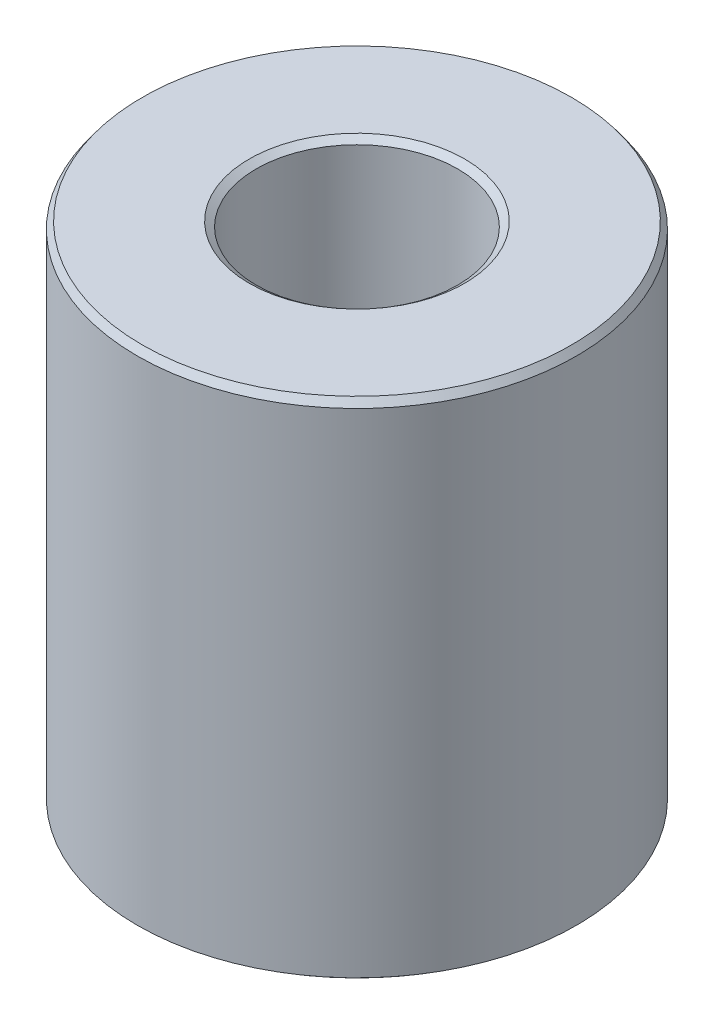
ISO-10303-21;
HEADER;
FILE_DESCRIPTION(('STEP AP214'),'2;1');
FILE_NAME('part.step','',(''),(''),'','','');
FILE_SCHEMA(('AUTOMOTIVE_DESIGN { 1 0 10303 214 1 1 1 1 }'));
ENDSEC;
DATA;
#1=APPLICATION_CONTEXT('core data for automotive mechanical design processes');
#2=APPLICATION_PROTOCOL_DEFINITION('international standard','automotive_design',2000,#1);
#3=PRODUCT_CONTEXT('',#1,'mechanical');
#4=PRODUCT('Part','Part','',(#3));
#5=PRODUCT_RELATED_PRODUCT_CATEGORY('part','',(#4));
#6=PRODUCT_DEFINITION_FORMATION('','',#4);
#7=PRODUCT_DEFINITION_CONTEXT('part definition',#1,'design');
#8=PRODUCT_DEFINITION('design','',#6,#7);
#9=PRODUCT_DEFINITION_SHAPE('','',#8);
#10=(LENGTH_UNIT() NAMED_UNIT(*) SI_UNIT(.MILLI.,.METRE.));
#11=(NAMED_UNIT(*) PLANE_ANGLE_UNIT() SI_UNIT($,.RADIAN.));
#12=(NAMED_UNIT(*) SI_UNIT($,.STERADIAN.) SOLID_ANGLE_UNIT());
#13=UNCERTAINTY_MEASURE_WITH_UNIT(LENGTH_MEASURE(1.E-05),#10,'distance_accuracy_value','');
#14=(GEOMETRIC_REPRESENTATION_CONTEXT(3) GLOBAL_UNCERTAINTY_ASSIGNED_CONTEXT((#13)) GLOBAL_UNIT_ASSIGNED_CONTEXT((#10,
#11,#12)) REPRESENTATION_CONTEXT('',''));
#15=CARTESIAN_POINT('',(0.,0.,0.));
#16=DIRECTION('',(0.,0.,1.));
#17=DIRECTION('',(1.,0.,0.));
#18=AXIS2_PLACEMENT_3D('',#15,#16,#17);
#19=CARTESIAN_POINT('',(0.,126.513965397112,0.));
#20=DIRECTION('',(0.,-1.,0.));
#21=DIRECTION('',(0.,0.,-1.));
#22=AXIS2_PLACEMENT_3D('',#19,#20,#21);
#23=CYLINDRICAL_SURFACE('',#22,55.);
#24=CARTESIAN_POINT('',(0.,1.26517147994276,0.));
#25=DIRECTION('',(0.,1.,0.));
#26=DIRECTION('',(0.,0.,1.));
#27=AXIS2_PLACEMENT_3D('',#24,#25,#26);
#28=CIRCLE('',#27,55.);
#29=CARTESIAN_POINT('',(0.,1.26517147994276,55.));
#30=VERTEX_POINT('',#29);
#31=EDGE_CURVE('E10',#30,#30,#28,.T.);
#32=ORIENTED_EDGE('',*,*,#31,.T.);
#33=EDGE_LOOP('',(#32));
#34=FACE_BOUND('',#33,.T.);
#35=CARTESIAN_POINT('',(0.,124.761026844225,0.));
#36=DIRECTION('',(0.,1.,0.));
#37=DIRECTION('',(0.,0.,1.));
#38=AXIS2_PLACEMENT_3D('',#35,#36,#37);
#39=CIRCLE('',#38,55.);
#40=CARTESIAN_POINT('',(0.,124.761026844225,55.));
#41=VERTEX_POINT('',#40);
#42=EDGE_CURVE('E50',#41,#41,#39,.F.);
#43=ORIENTED_EDGE('',*,*,#42,.T.);
#44=EDGE_LOOP('',(#43));
#45=FACE_BOUND('',#44,.T.);
#46=ADVANCED_FACE('F39',(#34,#45),#23,.T.);
#47=CARTESIAN_POINT('',(0.,126.513965397112,0.));
#48=DIRECTION('',(0.,1.,0.));
#49=DIRECTION('',(0.,0.,1.));
#50=AXIS2_PLACEMENT_3D('',#47,#48,#49);
#51=PLANE('',#50);
#52=CARTESIAN_POINT('',(0.,126.513965397112,0.));
#53=DIRECTION('',(0.,1.,0.));
#54=DIRECTION('',(0.,0.,1.));
#55=AXIS2_PLACEMENT_3D('',#52,#53,#54);
#56=CIRCLE('',#55,26.9830047385844);
#57=CARTESIAN_POINT('',(0.,126.513965397112,26.9830047385844));
#58=VERTEX_POINT('',#57);
#59=EDGE_CURVE('E58',#58,#58,#56,.F.);
#60=ORIENTED_EDGE('',*,*,#59,.T.);
#61=EDGE_LOOP('',(#60));
#62=FACE_BOUND('',#61,.T.);
#63=CARTESIAN_POINT('',(0.,126.513965397112,0.));
#64=DIRECTION('',(0.,1.,0.));
#65=DIRECTION('',(0.,0.,1.));
#66=AXIS2_PLACEMENT_3D('',#63,#64,#65);
#67=CIRCLE('',#66,53.7348285200572);
#68=CARTESIAN_POINT('',(0.,126.513965397112,53.7348285200572));
#69=VERTEX_POINT('',#68);
#70=EDGE_CURVE('E61',#69,#69,#67,.T.);
#71=ORIENTED_EDGE('',*,*,#70,.T.);
#72=EDGE_LOOP('',(#71));
#73=FACE_BOUND('',#72,.T.);
#74=ADVANCED_FACE('F88',(#62,#73),#51,.T.);
#75=CARTESIAN_POINT('',(0.,0.,0.));
#76=DIRECTION('',(0.,1.,0.));
#77=DIRECTION('',(0.,0.,1.));
#78=AXIS2_PLACEMENT_3D('',#75,#76,#77);
#79=PLANE('',#78);
#80=CARTESIAN_POINT('',(0.,0.,0.));
#81=DIRECTION('',(0.,1.,0.));
#82=DIRECTION('',(0.,0.,1.));
#83=AXIS2_PLACEMENT_3D('',#80,#81,#82);
#84=CIRCLE('',#83,26.4952376656398);
#85=CARTESIAN_POINT('',(0.,0.,-26.4952376656398));
#86=VERTEX_POINT('',#85);
#87=EDGE_CURVE('E51',#86,#86,#84,.T.);
#88=ORIENTED_EDGE('',*,*,#87,.T.);
#89=EDGE_LOOP('',(#88));
#90=FACE_BOUND('',#89,.T.);
#91=CARTESIAN_POINT('',(0.,0.,0.));
#92=DIRECTION('',(0.,1.,0.));
#93=DIRECTION('',(0.,0.,1.));
#94=AXIS2_PLACEMENT_3D('',#91,#92,#93);
#95=CIRCLE('',#94,53.2470614471127);
#96=CARTESIAN_POINT('',(0.,0.,53.2470614471127));
#97=VERTEX_POINT('',#96);
#98=EDGE_CURVE('E54',#97,#97,#95,.F.);
#99=ORIENTED_EDGE('',*,*,#98,.T.);
#100=EDGE_LOOP('',(#99));
#101=FACE_BOUND('',#100,.T.);
#102=ADVANCED_FACE('F83',(#90,#101),#79,.F.);
#103=CARTESIAN_POINT('',(0.,126.513965397112,0.));
#104=DIRECTION('',(0.,-1.,0.));
#105=DIRECTION('',(0.,0.,-1.));
#106=AXIS2_PLACEMENT_3D('',#103,#104,#105);
#107=CYLINDRICAL_SURFACE('',#106,25.230066185697);
#108=CARTESIAN_POINT('',(0.,125.248793917169,0.));
#109=DIRECTION('',(0.,1.,0.));
#110=DIRECTION('',(0.,0.,1.));
#111=AXIS2_PLACEMENT_3D('',#108,#109,#110);
#112=CIRCLE('',#111,25.230066185697);
#113=CARTESIAN_POINT('',(0.,125.248793917169,25.230066185697));
#114=VERTEX_POINT('',#113);
#115=EDGE_CURVE('E67',#114,#114,#112,.T.);
#116=ORIENTED_EDGE('',*,*,#115,.T.);
#117=EDGE_LOOP('',(#116));
#118=FACE_BOUND('',#117,.T.);
#119=CARTESIAN_POINT('',(0.,1.75293855288738,0.));
#120=DIRECTION('',(0.,1.,0.));
#121=DIRECTION('',(0.,0.,1.));
#122=AXIS2_PLACEMENT_3D('',#119,#120,#121);
#123=CIRCLE('',#122,25.230066185697);
#124=CARTESIAN_POINT('',(0.,1.75293855288738,-25.230066185697));
#125=VERTEX_POINT('',#124);
#126=EDGE_CURVE('E69',#125,#125,#123,.F.);
#127=ORIENTED_EDGE('',*,*,#126,.T.);
#128=EDGE_LOOP('',(#127));
#129=FACE_BOUND('',#128,.T.);
#130=ADVANCED_FACE('F71',(#118,#129),#107,.F.);
#131=CARTESIAN_POINT('',(0.,125.248793917169,0.));
#132=DIRECTION('',(0.,1.,0.));
#133=DIRECTION('',(0.,0.,1.));
#134=AXIS2_PLACEMENT_3D('',#131,#132,#133);
#135=CONICAL_SURFACE('',#134,25.230066185697,0.945626172165567);
#136=ORIENTED_EDGE('',*,*,#59,.F.);
#137=EDGE_LOOP('',(#136));
#138=FACE_BOUND('',#137,.T.);
#139=ORIENTED_EDGE('',*,*,#115,.F.);
#140=EDGE_LOOP('',(#139));
#141=FACE_BOUND('',#140,.T.);
#142=ADVANCED_FACE('F77',(#138,#141),#135,.F.);
#143=CARTESIAN_POINT('',(0.,0.,0.));
#144=DIRECTION('',(0.,-1.,0.));
#145=DIRECTION('',(0.,0.,-1.));
#146=AXIS2_PLACEMENT_3D('',#143,#144,#145);
#147=CONICAL_SURFACE('',#146,26.4952376656398,0.62517015462933);
#148=CARTESIAN_POINT('',(0.,1.75293855288738,-25.230066185697));
#149=CARTESIAN_POINT('',(0.,1.73467877629481,-25.2432450552798));
#150=CARTESIAN_POINT('',(0.,1.71641899970223,-25.2564239248625));
#151=CARTESIAN_POINT('',(0.,1.67989944651708,-25.282781664028));
#152=CARTESIAN_POINT('',(0.,1.6616396699245,-25.2959605336107));
#153=CARTESIAN_POINT('',(0.,1.62512011673935,-25.3223182727762));
#154=CARTESIAN_POINT('',(0.,1.60686034014677,-25.3354971423589));
#155=CARTESIAN_POINT('',(0.,1.57034078696162,-25.3618548815244));
#156=CARTESIAN_POINT('',(0.,1.55208101036904,-25.3750337511071));
#157=CARTESIAN_POINT('',(0.,1.51556145718388,-25.4013914902726));
#158=CARTESIAN_POINT('',(0.,1.49730168059131,-25.4145703598554));
#159=CARTESIAN_POINT('',(0.,1.46078212740615,-25.4409280990208));
#160=CARTESIAN_POINT('',(0.,1.44252235081358,-25.4541069686036));
#161=CARTESIAN_POINT('',(0.,1.40600279762842,-25.480464707769));
#162=CARTESIAN_POINT('',(0.,1.38774302103585,-25.4936435773518));
#163=CARTESIAN_POINT('',(0.,1.35122346785069,-25.5200013165173));
#164=CARTESIAN_POINT('',(0.,1.33296369125811,-25.5331801861));
#165=CARTESIAN_POINT('',(0.,1.29644413807296,-25.5595379252655));
#166=CARTESIAN_POINT('',(0.,1.27818436148038,-25.5727167948482));
#167=CARTESIAN_POINT('',(0.,1.24166480829523,-25.5990745340137));
#168=CARTESIAN_POINT('',(0.,1.22340503170265,-25.6122534035964));
#169=CARTESIAN_POINT('',(0.,1.1868854785175,-25.6386111427619));
#170=CARTESIAN_POINT('',(0.,1.16862570192492,-25.6517900123446));
#171=CARTESIAN_POINT('',(0.,1.13210614873977,-25.6781477515101));
#172=CARTESIAN_POINT('',(0.,1.11384637214719,-25.6913266210928));
#173=CARTESIAN_POINT('',(0.,1.07732681896204,-25.7176843602583));
#174=CARTESIAN_POINT('',(0.,1.05906704236946,-25.7308632298411));
#175=CARTESIAN_POINT('',(0.,1.02254748918431,-25.7572209690065));
#176=CARTESIAN_POINT('',(0.,1.00428771259173,-25.7703998385893));
#177=CARTESIAN_POINT('',(0.,0.967768159406577,-25.7967575777547));
#178=CARTESIAN_POINT('',(0.,0.949508382814,-25.8099364473375));
#179=CARTESIAN_POINT('',(0.,0.912988829628846,-25.836294186503));
#180=CARTESIAN_POINT('',(0.,0.894729053036269,-25.8494730560857));
#181=CARTESIAN_POINT('',(0.,0.858209499851115,-25.8758307952512));
#182=CARTESIAN_POINT('',(0.,0.839949723258538,-25.8890096648339));
#183=CARTESIAN_POINT('',(0.,0.803430170073385,-25.9153674039994));
#184=CARTESIAN_POINT('',(0.,0.785170393480808,-25.9285462735821));
#185=CARTESIAN_POINT('',(0.,0.748650840295654,-25.9549040127476));
#186=CARTESIAN_POINT('',(0.,0.730391063703077,-25.9680828823303));
#187=CARTESIAN_POINT('',(0.,0.693871510517923,-25.9944406214958));
#188=CARTESIAN_POINT('',(0.,0.675611733925346,-26.0076194910785));
#189=CARTESIAN_POINT('',(0.,0.639092180740192,-26.033977230244));
#190=CARTESIAN_POINT('',(0.,0.620832404147615,-26.0471560998268));
#191=CARTESIAN_POINT('',(0.,0.584312850962462,-26.0735138389922));
#192=CARTESIAN_POINT('',(0.,0.566053074369885,-26.086692708575));
#193=CARTESIAN_POINT('',(0.,0.529533521184731,-26.1130504477404));
#194=CARTESIAN_POINT('',(0.,0.511273744592154,-26.1262293173232));
#195=CARTESIAN_POINT('',(0.,0.474754191407,-26.1525870564887));
#196=CARTESIAN_POINT('',(0.,0.456494414814423,-26.1657659260714));
#197=CARTESIAN_POINT('',(0.,0.419974861629269,-26.1921236652369));
#198=CARTESIAN_POINT('',(0.,0.401715085036692,-26.2053025348196));
#199=CARTESIAN_POINT('',(0.,0.365195531851538,-26.2316602739851));
#200=CARTESIAN_POINT('',(0.,0.346935755258962,-26.2448391435678));
#201=CARTESIAN_POINT('',(0.,0.310416202073808,-26.2711968827333));
#202=CARTESIAN_POINT('',(0.,0.292156425481231,-26.284375752316));
#203=CARTESIAN_POINT('',(0.,0.255636872296077,-26.3107334914815));
#204=CARTESIAN_POINT('',(0.,0.2373770957035,-26.3239123610642));
#205=CARTESIAN_POINT('',(0.,0.200857542518346,-26.3502701002297));
#206=CARTESIAN_POINT('',(0.,0.182597765925769,-26.3634489698124));
#207=CARTESIAN_POINT('',(0.,0.146078212740615,-26.3898067089779));
#208=CARTESIAN_POINT('',(0.,0.127818436148039,-26.4029855785607));
#209=CARTESIAN_POINT('',(0.,0.091298882962885,-26.4293433177261));
#210=CARTESIAN_POINT('',(0.,0.0730391063703079,-26.4425221873089));
#211=CARTESIAN_POINT('',(0.,0.0365195531851536,-26.4688799264744));
#212=CARTESIAN_POINT('',(0.,0.0182597765925765,-26.4820587960571));
#213=CARTESIAN_POINT('',(0.,0.,-26.4952376656398));
#214=B_SPLINE_CURVE_WITH_KNOTS('',3,(#148,#149,#150,#151,#152,#153,#154,#155,#156,#157,#158,
#159,#160,#161,#162,#163,#164,#165,#166,#167,#168,#169,#170,#171,#172,#173,#174,#175,#176,#177,
#178,#179,#180,#181,#182,#183,#184,#185,#186,#187,#188,#189,#190,#191,#192,#193,#194,#195,#196,
#197,#198,#199,#200,#201,#202,#203,#204,#205,#206,#207,#208,#209,#210,#211,#212,#213),
.UNSPECIFIED.,.F.,.F.,(4,2,2,2,2,2,2,2,2,2,2,2,2,2,2,2,2,2,2,2,2,2,2,2,2,2,2,2,2,2,2,2,4),(0.,
0.0675567790988182,0.135113558197636,0.202670337296457,0.270227116395275,0.337783895494093,
0.405340674592911,0.472897453691731,0.54045423279055,0.608011011889368,0.675567790988186,
0.743124570087004,0.810681349185824,0.878238128284643,0.945794907383461,1.01335168648228,
1.0809084655811,1.14846524467992,1.21602202377874,1.28357880287755,1.35113558197637,
1.41869236107519,1.48624914017401,1.55380591927283,1.62136269837165,1.68891947747046,
1.75647625656928,1.8240330356681,1.89158981476692,1.95914659386574,2.02670337296456,
2.09426015206338,2.1618169311622),.UNSPECIFIED.);
#215=EDGE_CURVE('BSEAM73',#125,#86,#214,.T.);
#216=ORIENTED_EDGE('',*,*,#126,.F.);
#217=ORIENTED_EDGE('',*,*,#87,.F.);
#218=ORIENTED_EDGE('',*,*,#215,.T.);
#219=ORIENTED_EDGE('',*,*,#215,.F.);
#220=EDGE_LOOP('',(#216,#218,#217,#219));
#221=FACE_BOUND('',#220,.T.);
#222=ADVANCED_FACE('F73',(#221),#147,.F.);
#223=CARTESIAN_POINT('',(0.,1.26517147994276,0.));
#224=DIRECTION('',(0.,1.,0.));
#225=DIRECTION('',(0.,0.,1.));
#226=AXIS2_PLACEMENT_3D('',#223,#224,#225);
#227=CONICAL_SURFACE('',#226,55.,0.945626172165564);
#228=ORIENTED_EDGE('',*,*,#98,.F.);
#229=EDGE_LOOP('',(#228));
#230=FACE_BOUND('',#229,.T.);
#231=ORIENTED_EDGE('',*,*,#31,.F.);
#232=EDGE_LOOP('',(#231));
#233=FACE_BOUND('',#232,.T.);
#234=ADVANCED_FACE('F76',(#230,#233),#227,.T.);
#235=CARTESIAN_POINT('',(0.,126.513965397112,0.));
#236=DIRECTION('',(0.,-1.,0.));
#237=DIRECTION('',(0.,0.,-1.));
#238=AXIS2_PLACEMENT_3D('',#235,#236,#237);
#239=CONICAL_SURFACE('',#238,53.7348285200572,0.625170154629332);
#240=ORIENTED_EDGE('',*,*,#42,.F.);
#241=EDGE_LOOP('',(#240));
#242=FACE_BOUND('',#241,.T.);
#243=ORIENTED_EDGE('',*,*,#70,.F.);
#244=EDGE_LOOP('',(#243));
#245=FACE_BOUND('',#244,.T.);
#246=ADVANCED_FACE('F45',(#242,#245),#239,.T.);
#247=CLOSED_SHELL('',(#46,#74,#102,#130,#142,#222,#234,#246));
#248=MANIFOLD_SOLID_BREP('B2',#247);
#249=ADVANCED_BREP_SHAPE_REPRESENTATION('',(#18,#248),#14);
#250=SHAPE_DEFINITION_REPRESENTATION(#9,#249);
ENDSEC;
END-ISO-10303-21;
